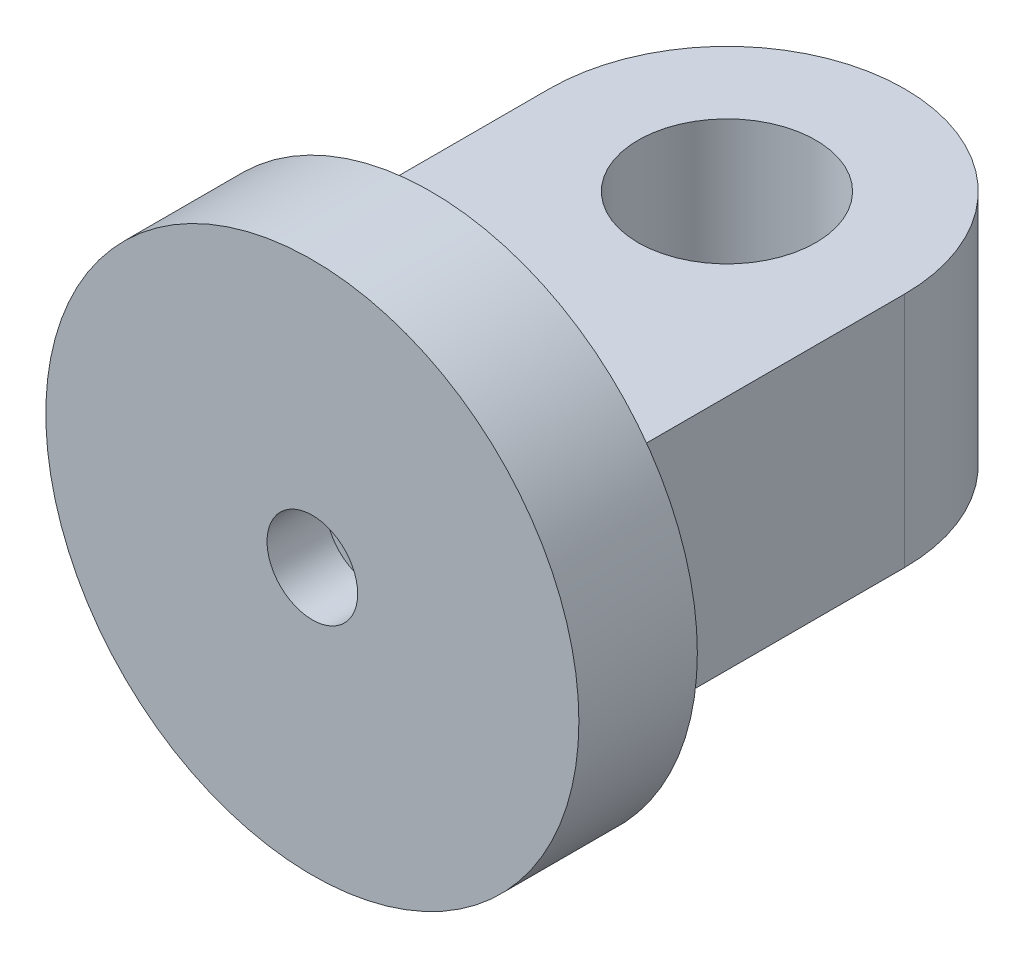
ISO-10303-21;
HEADER;
FILE_DESCRIPTION(('STEP AP214'),'2;1');
FILE_NAME('part.step','',(''),(''),'','','');
FILE_SCHEMA(('AUTOMOTIVE_DESIGN { 1 0 10303 214 1 1 1 1 }'));
ENDSEC;
DATA;
#1=APPLICATION_CONTEXT('core data for automotive mechanical design processes');
#2=APPLICATION_PROTOCOL_DEFINITION('international standard','automotive_design',2000,#1);
#3=PRODUCT_CONTEXT('',#1,'mechanical');
#4=PRODUCT('Part','Part','',(#3));
#5=PRODUCT_RELATED_PRODUCT_CATEGORY('part','',(#4));
#6=PRODUCT_DEFINITION_FORMATION('','',#4);
#7=PRODUCT_DEFINITION_CONTEXT('part definition',#1,'design');
#8=PRODUCT_DEFINITION('design','',#6,#7);
#9=PRODUCT_DEFINITION_SHAPE('','',#8);
#10=(LENGTH_UNIT() NAMED_UNIT(*) SI_UNIT(.MILLI.,.METRE.));
#11=(NAMED_UNIT(*) PLANE_ANGLE_UNIT() SI_UNIT($,.RADIAN.));
#12=(NAMED_UNIT(*) SI_UNIT($,.STERADIAN.) SOLID_ANGLE_UNIT());
#13=UNCERTAINTY_MEASURE_WITH_UNIT(LENGTH_MEASURE(1.E-05),#10,'distance_accuracy_value','');
#14=(GEOMETRIC_REPRESENTATION_CONTEXT(3) GLOBAL_UNCERTAINTY_ASSIGNED_CONTEXT((#13)) GLOBAL_UNIT_ASSIGNED_CONTEXT((#10,
#11,#12)) REPRESENTATION_CONTEXT('',''));
#15=CARTESIAN_POINT('',(0.,0.,0.));
#16=DIRECTION('',(0.,0.,1.));
#17=DIRECTION('',(1.,0.,0.));
#18=AXIS2_PLACEMENT_3D('',#15,#16,#17);
#19=CARTESIAN_POINT('',(-30.,-20.,0.));
#20=DIRECTION('',(-1.,0.,0.));
#21=DIRECTION('',(0.,0.,1.));
#22=AXIS2_PLACEMENT_3D('',#19,#20,#21);
#23=PLANE('',#22);
#24=DIRECTION('',(0.,0.,1.));
#25=VECTOR('',#24,1.);
#26=CARTESIAN_POINT('',(-30.,20.,0.));
#27=LINE('',#26,#25);
#28=CARTESIAN_POINT('',(-30.,20.,-50.));
#29=VERTEX_POINT('',#28);
#30=CARTESIAN_POINT('',(-30.,20.,0.));
#31=VERTEX_POINT('',#30);
#32=EDGE_CURVE('E83',#29,#31,#27,.T.);
#33=ORIENTED_EDGE('',*,*,#32,.F.);
#34=DIRECTION('',(0.,1.,0.));
#35=VECTOR('',#34,1.);
#36=CARTESIAN_POINT('',(-30.,-20.,-50.));
#37=LINE('',#36,#35);
#38=CARTESIAN_POINT('',(-30.,-20.,-50.));
#39=VERTEX_POINT('',#38);
#40=EDGE_CURVE('E45',#39,#29,#37,.T.);
#41=ORIENTED_EDGE('',*,*,#40,.F.);
#42=DIRECTION('',(0.,0.,1.));
#43=VECTOR('',#42,1.);
#44=CARTESIAN_POINT('',(-30.,-20.,0.));
#45=LINE('',#44,#43);
#46=CARTESIAN_POINT('',(-30.,-20.,0.));
#47=VERTEX_POINT('',#46);
#48=EDGE_CURVE('E93',#39,#47,#45,.T.);
#49=ORIENTED_EDGE('',*,*,#48,.T.);
#50=DIRECTION('',(0.,1.,0.));
#51=VECTOR('',#50,1.);
#52=CARTESIAN_POINT('',(-30.,-20.,0.));
#53=LINE('',#52,#51);
#54=EDGE_CURVE('E11',#47,#31,#53,.T.);
#55=ORIENTED_EDGE('',*,*,#54,.T.);
#56=EDGE_LOOP('',(#33,#41,#49,#55));
#57=FACE_BOUND('',#56,.T.);
#58=ADVANCED_FACE('F35',(#57),#23,.T.);
#59=CARTESIAN_POINT('',(0.,-20.,-50.));
#60=DIRECTION('',(0.,1.,0.));
#61=DIRECTION('',(0.,0.,1.));
#62=AXIS2_PLACEMENT_3D('',#59,#60,#61);
#63=CYLINDRICAL_SURFACE('',#62,30.);
#64=CARTESIAN_POINT('',(0.,20.,-50.));
#65=DIRECTION('',(0.,1.,0.));
#66=DIRECTION('',(0.,0.,-1.));
#67=AXIS2_PLACEMENT_3D('',#64,#65,#66);
#68=CIRCLE('',#67,30.);
#69=CARTESIAN_POINT('',(30.,20.,-50.));
#70=VERTEX_POINT('',#69);
#71=EDGE_CURVE('E72',#70,#29,#68,.T.);
#72=ORIENTED_EDGE('',*,*,#71,.F.);
#73=DIRECTION('',(0.,1.,0.));
#74=VECTOR('',#73,1.);
#75=CARTESIAN_POINT('',(30.,-20.,-50.));
#76=LINE('',#75,#74);
#77=CARTESIAN_POINT('',(30.,-20.,-50.));
#78=VERTEX_POINT('',#77);
#79=EDGE_CURVE('E67',#78,#70,#76,.T.);
#80=ORIENTED_EDGE('',*,*,#79,.F.);
#81=CARTESIAN_POINT('',(0.,-20.,-50.));
#82=DIRECTION('',(0.,1.,0.));
#83=DIRECTION('',(0.,0.,-1.));
#84=AXIS2_PLACEMENT_3D('',#81,#82,#83);
#85=CIRCLE('',#84,30.);
#86=EDGE_CURVE('E75',#78,#39,#85,.T.);
#87=ORIENTED_EDGE('',*,*,#86,.T.);
#88=ORIENTED_EDGE('',*,*,#40,.T.);
#89=EDGE_LOOP('',(#72,#80,#87,#88));
#90=FACE_BOUND('',#89,.T.);
#91=ADVANCED_FACE('F71',(#90),#63,.T.);
#92=CARTESIAN_POINT('',(30.,-20.,0.));
#93=DIRECTION('',(1.,0.,0.));
#94=DIRECTION('',(0.,0.,-1.));
#95=AXIS2_PLACEMENT_3D('',#92,#93,#94);
#96=PLANE('',#95);
#97=DIRECTION('',(0.,0.,-1.));
#98=VECTOR('',#97,1.);
#99=CARTESIAN_POINT('',(30.,20.,0.));
#100=LINE('',#99,#98);
#101=CARTESIAN_POINT('',(30.,20.,0.));
#102=VERTEX_POINT('',#101);
#103=EDGE_CURVE('E84',#102,#70,#100,.T.);
#104=ORIENTED_EDGE('',*,*,#103,.F.);
#105=DIRECTION('',(0.,1.,0.));
#106=VECTOR('',#105,1.);
#107=CARTESIAN_POINT('',(30.,-20.,0.));
#108=LINE('',#107,#106);
#109=CARTESIAN_POINT('',(30.,-20.,0.));
#110=VERTEX_POINT('',#109);
#111=EDGE_CURVE('E39',#110,#102,#108,.T.);
#112=ORIENTED_EDGE('',*,*,#111,.F.);
#113=DIRECTION('',(0.,0.,-1.));
#114=VECTOR('',#113,1.);
#115=CARTESIAN_POINT('',(30.,-20.,0.));
#116=LINE('',#115,#114);
#117=EDGE_CURVE('E90',#110,#78,#116,.T.);
#118=ORIENTED_EDGE('',*,*,#117,.T.);
#119=ORIENTED_EDGE('',*,*,#79,.T.);
#120=EDGE_LOOP('',(#104,#112,#118,#119));
#121=FACE_BOUND('',#120,.T.);
#122=ADVANCED_FACE('F37',(#121),#96,.T.);
#123=CARTESIAN_POINT('',(0.,-20.,-50.));
#124=DIRECTION('',(0.,-1.,0.));
#125=DIRECTION('',(0.,0.,-1.));
#126=AXIS2_PLACEMENT_3D('',#123,#124,#125);
#127=PLANE('',#126);
#128=CARTESIAN_POINT('',(0.,-20.,-50.));
#129=DIRECTION('',(0.,1.,0.));
#130=DIRECTION('',(0.,0.,1.));
#131=AXIS2_PLACEMENT_3D('',#128,#129,#130);
#132=CIRCLE('',#131,15.);
#133=CARTESIAN_POINT('',(0.,-20.,-35.));
#134=VERTEX_POINT('',#133);
#135=EDGE_CURVE('E102',#134,#134,#132,.T.);
#136=ORIENTED_EDGE('',*,*,#135,.T.);
#137=EDGE_LOOP('',(#136));
#138=FACE_BOUND('',#137,.T.);
#139=DIRECTION('',(1.,0.,0.));
#140=VECTOR('',#139,1.);
#141=CARTESIAN_POINT('',(-30.,-20.,0.));
#142=LINE('',#141,#140);
#143=EDGE_CURVE('E87',#47,#110,#142,.T.);
#144=ORIENTED_EDGE('',*,*,#143,.F.);
#145=ORIENTED_EDGE('',*,*,#48,.F.);
#146=ORIENTED_EDGE('',*,*,#86,.F.);
#147=ORIENTED_EDGE('',*,*,#117,.F.);
#148=EDGE_LOOP('',(#144,#145,#146,#147));
#149=FACE_BOUND('',#148,.T.);
#150=ADVANCED_FACE('F118',(#138,#149),#127,.T.);
#151=CARTESIAN_POINT('',(0.,20.,-50.));
#152=DIRECTION('',(0.,-1.,0.));
#153=DIRECTION('',(0.,0.,-1.));
#154=AXIS2_PLACEMENT_3D('',#151,#152,#153);
#155=PLANE('',#154);
#156=CARTESIAN_POINT('',(0.,20.,-50.));
#157=DIRECTION('',(0.,1.,0.));
#158=DIRECTION('',(0.,0.,1.));
#159=AXIS2_PLACEMENT_3D('',#156,#157,#158);
#160=CIRCLE('',#159,15.);
#161=CARTESIAN_POINT('',(0.,20.,-35.));
#162=VERTEX_POINT('',#161);
#163=EDGE_CURVE('E104',#162,#162,#160,.T.);
#164=ORIENTED_EDGE('',*,*,#163,.F.);
#165=EDGE_LOOP('',(#164));
#166=FACE_BOUND('',#165,.T.);
#167=DIRECTION('',(1.,0.,0.));
#168=VECTOR('',#167,1.);
#169=CARTESIAN_POINT('',(-30.,20.,0.));
#170=LINE('',#169,#168);
#171=EDGE_CURVE('E101',#31,#102,#170,.T.);
#172=ORIENTED_EDGE('',*,*,#171,.T.);
#173=ORIENTED_EDGE('',*,*,#103,.T.);
#174=ORIENTED_EDGE('',*,*,#71,.T.);
#175=ORIENTED_EDGE('',*,*,#32,.T.);
#176=EDGE_LOOP('',(#172,#173,#174,#175));
#177=FACE_BOUND('',#176,.T.);
#178=ADVANCED_FACE('F81',(#166,#177),#155,.F.);
#179=CARTESIAN_POINT('',(0.,-20.,-50.));
#180=DIRECTION('',(0.,1.,0.));
#181=DIRECTION('',(0.,0.,1.));
#182=AXIS2_PLACEMENT_3D('',#179,#180,#181);
#183=CYLINDRICAL_SURFACE('',#182,15.);
#184=ORIENTED_EDGE('',*,*,#135,.F.);
#185=EDGE_LOOP('',(#184));
#186=FACE_BOUND('',#185,.T.);
#187=ORIENTED_EDGE('',*,*,#163,.T.);
#188=EDGE_LOOP('',(#187));
#189=FACE_BOUND('',#188,.T.);
#190=ADVANCED_FACE('F149',(#186,#189),#183,.F.);
#191=CARTESIAN_POINT('',(0.,0.,20.));
#192=DIRECTION('',(0.,0.,-1.));
#193=DIRECTION('',(-1.,0.,0.));
#194=AXIS2_PLACEMENT_3D('',#191,#192,#193);
#195=CYLINDRICAL_SURFACE('',#194,45.);
#196=CARTESIAN_POINT('',(0.,0.,20.));
#197=DIRECTION('',(0.,0.,1.));
#198=DIRECTION('',(1.,0.,0.));
#199=AXIS2_PLACEMENT_3D('',#196,#197,#198);
#200=CIRCLE('',#199,45.);
#201=CARTESIAN_POINT('',(45.,0.,20.));
#202=VERTEX_POINT('',#201);
#203=EDGE_CURVE('E109',#202,#202,#200,.T.);
#204=ORIENTED_EDGE('',*,*,#203,.F.);
#205=EDGE_LOOP('',(#204));
#206=FACE_BOUND('',#205,.T.);
#207=CARTESIAN_POINT('',(0.,0.,0.));
#208=DIRECTION('',(0.,0.,1.));
#209=DIRECTION('',(1.,0.,0.));
#210=AXIS2_PLACEMENT_3D('',#207,#208,#209);
#211=CIRCLE('',#210,45.);
#212=CARTESIAN_POINT('',(45.,0.,0.));
#213=VERTEX_POINT('',#212);
#214=EDGE_CURVE('E112',#213,#213,#211,.T.);
#215=ORIENTED_EDGE('',*,*,#214,.T.);
#216=EDGE_LOOP('',(#215));
#217=FACE_BOUND('',#216,.T.);
#218=ADVANCED_FACE('F144',(#206,#217),#195,.T.);
#219=CARTESIAN_POINT('',(0.,0.,20.));
#220=DIRECTION('',(0.,0.,1.));
#221=DIRECTION('',(1.,0.,0.));
#222=AXIS2_PLACEMENT_3D('',#219,#220,#221);
#223=PLANE('',#222);
#224=CARTESIAN_POINT('',(0.,0.,20.));
#225=DIRECTION('',(0.,0.,1.));
#226=DIRECTION('',(1.,0.,0.));
#227=AXIS2_PLACEMENT_3D('',#224,#225,#226);
#228=CIRCLE('',#227,7.65);
#229=CARTESIAN_POINT('',(7.65,0.,20.));
#230=VERTEX_POINT('',#229);
#231=EDGE_CURVE('E133',#230,#230,#228,.T.);
#232=ORIENTED_EDGE('',*,*,#231,.F.);
#233=EDGE_LOOP('',(#232));
#234=FACE_BOUND('',#233,.T.);
#235=ORIENTED_EDGE('',*,*,#203,.T.);
#236=EDGE_LOOP('',(#235));
#237=FACE_BOUND('',#236,.T.);
#238=ADVANCED_FACE('F125',(#234,#237),#223,.T.);
#239=CARTESIAN_POINT('',(0.,0.,0.));
#240=DIRECTION('',(0.,0.,1.));
#241=DIRECTION('',(1.,0.,0.));
#242=AXIS2_PLACEMENT_3D('',#239,#240,#241);
#243=PLANE('',#242);
#244=ORIENTED_EDGE('',*,*,#143,.T.);
#245=ORIENTED_EDGE('',*,*,#111,.T.);
#246=ORIENTED_EDGE('',*,*,#171,.F.);
#247=ORIENTED_EDGE('',*,*,#54,.F.);
#248=EDGE_LOOP('',(#244,#245,#246,#247));
#249=FACE_BOUND('',#248,.T.);
#250=ORIENTED_EDGE('',*,*,#214,.F.);
#251=EDGE_LOOP('',(#250));
#252=FACE_BOUND('',#251,.T.);
#253=ADVANCED_FACE('F121',(#249,#252),#243,.F.);
#254=CARTESIAN_POINT('',(0.,0.,10.));
#255=DIRECTION('',(0.,0.,1.));
#256=DIRECTION('',(1.,0.,0.));
#257=AXIS2_PLACEMENT_3D('',#254,#255,#256);
#258=CYLINDRICAL_SURFACE('',#257,7.65);
#259=CARTESIAN_POINT('',(0.,0.,10.));
#260=DIRECTION('',(0.,0.,1.));
#261=DIRECTION('',(1.,0.,0.));
#262=AXIS2_PLACEMENT_3D('',#259,#260,#261);
#263=CIRCLE('',#262,7.65);
#264=CARTESIAN_POINT('',(7.65,0.,10.));
#265=VERTEX_POINT('',#264);
#266=EDGE_CURVE('E130',#265,#265,#263,.T.);
#267=ORIENTED_EDGE('',*,*,#266,.F.);
#268=EDGE_LOOP('',(#267));
#269=FACE_BOUND('',#268,.T.);
#270=ORIENTED_EDGE('',*,*,#231,.T.);
#271=EDGE_LOOP('',(#270));
#272=FACE_BOUND('',#271,.T.);
#273=ADVANCED_FACE('F124',(#269,#272),#258,.F.);
#274=CARTESIAN_POINT('',(0.,0.,10.));
#275=DIRECTION('',(0.,0.,1.));
#276=DIRECTION('',(1.,0.,0.));
#277=AXIS2_PLACEMENT_3D('',#274,#275,#276);
#278=PLANE('',#277);
#279=ORIENTED_EDGE('',*,*,#266,.T.);
#280=EDGE_LOOP('',(#279));
#281=FACE_BOUND('',#280,.T.);
#282=ADVANCED_FACE('F221',(#281),#278,.T.);
#283=CLOSED_SHELL('',(#58,#91,#122,#150,#178,#190,#218,#238,#253,#273,#282));
#284=MANIFOLD_SOLID_BREP('B2',#283);
#285=ADVANCED_BREP_SHAPE_REPRESENTATION('',(#18,#284),#14);
#286=SHAPE_DEFINITION_REPRESENTATION(#9,#285);
ENDSEC;
END-ISO-10303-21;
